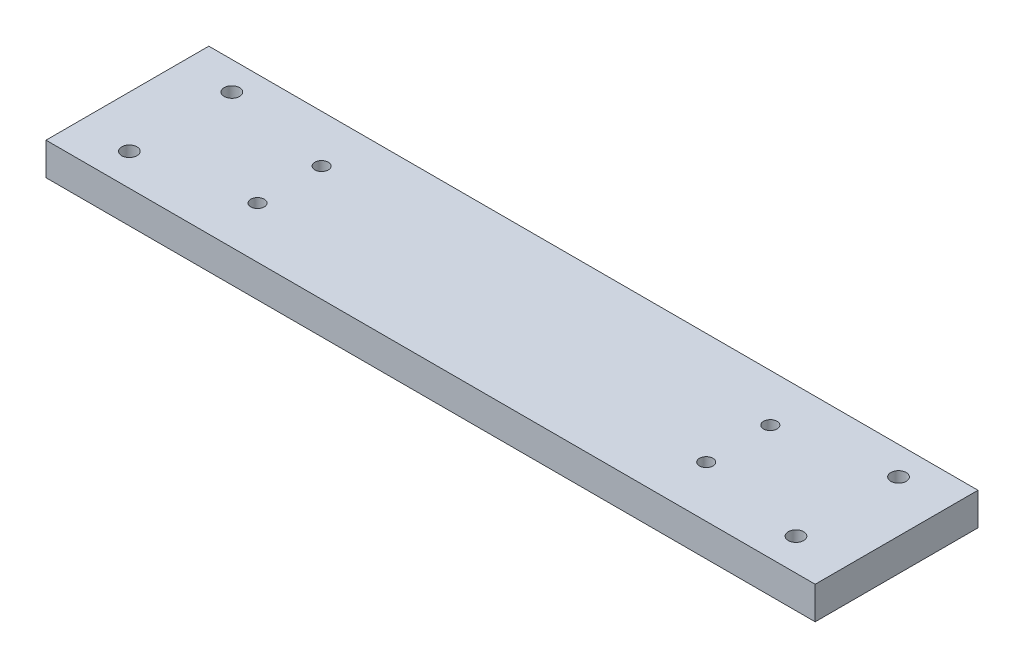
ISO-10303-21;
HEADER;
FILE_DESCRIPTION(('STEP AP214'),'2;1');
FILE_NAME('part.step','',(''),(''),'','','');
FILE_SCHEMA(('AUTOMOTIVE_DESIGN { 1 0 10303 214 1 1 1 1 }'));
ENDSEC;
DATA;
#1=APPLICATION_CONTEXT('core data for automotive mechanical design processes');
#2=APPLICATION_PROTOCOL_DEFINITION('international standard','automotive_design',2000,#1);
#3=PRODUCT_CONTEXT('',#1,'mechanical');
#4=PRODUCT('Part','Part','',(#3));
#5=PRODUCT_RELATED_PRODUCT_CATEGORY('part','',(#4));
#6=PRODUCT_DEFINITION_FORMATION('','',#4);
#7=PRODUCT_DEFINITION_CONTEXT('part definition',#1,'design');
#8=PRODUCT_DEFINITION('design','',#6,#7);
#9=PRODUCT_DEFINITION_SHAPE('','',#8);
#10=(LENGTH_UNIT() NAMED_UNIT(*) SI_UNIT(.MILLI.,.METRE.));
#11=(NAMED_UNIT(*) PLANE_ANGLE_UNIT() SI_UNIT($,.RADIAN.));
#12=(NAMED_UNIT(*) SI_UNIT($,.STERADIAN.) SOLID_ANGLE_UNIT());
#13=UNCERTAINTY_MEASURE_WITH_UNIT(LENGTH_MEASURE(1.E-05),#10,'distance_accuracy_value','');
#14=(GEOMETRIC_REPRESENTATION_CONTEXT(3) GLOBAL_UNCERTAINTY_ASSIGNED_CONTEXT((#13)) GLOBAL_UNIT_ASSIGNED_CONTEXT((#10,
#11,#12)) REPRESENTATION_CONTEXT('',''));
#15=CARTESIAN_POINT('',(0.,0.,0.));
#16=DIRECTION('',(0.,0.,1.));
#17=DIRECTION('',(1.,0.,0.));
#18=AXIS2_PLACEMENT_3D('',#15,#16,#17);
#19=CARTESIAN_POINT('',(0.,25.4,0.));
#20=DIRECTION('',(1.,0.,0.));
#21=DIRECTION('',(0.,0.,-1.));
#22=AXIS2_PLACEMENT_3D('',#19,#20,#21);
#23=PLANE('',#22);
#24=DIRECTION('',(0.,0.,1.));
#25=VECTOR('',#24,1.);
#26=CARTESIAN_POINT('',(0.,0.,0.));
#27=LINE('',#26,#25);
#28=CARTESIAN_POINT('',(0.,0.,-127.));
#29=VERTEX_POINT('',#28);
#30=CARTESIAN_POINT('',(0.,0.,0.));
#31=VERTEX_POINT('',#30);
#32=EDGE_CURVE('E96',#29,#31,#27,.T.);
#33=ORIENTED_EDGE('',*,*,#32,.T.);
#34=DIRECTION('',(0.,-1.,0.));
#35=VECTOR('',#34,1.);
#36=CARTESIAN_POINT('',(0.,25.4,0.));
#37=LINE('',#36,#35);
#38=CARTESIAN_POINT('',(0.,25.4,0.));
#39=VERTEX_POINT('',#38);
#40=EDGE_CURVE('E11',#39,#31,#37,.T.);
#41=ORIENTED_EDGE('',*,*,#40,.F.);
#42=DIRECTION('',(0.,0.,1.));
#43=VECTOR('',#42,1.);
#44=CARTESIAN_POINT('',(0.,25.4,0.));
#45=LINE('',#44,#43);
#46=CARTESIAN_POINT('',(0.,25.4,-127.));
#47=VERTEX_POINT('',#46);
#48=EDGE_CURVE('E84',#47,#39,#45,.T.);
#49=ORIENTED_EDGE('',*,*,#48,.F.);
#50=DIRECTION('',(0.,-1.,0.));
#51=VECTOR('',#50,1.);
#52=CARTESIAN_POINT('',(0.,25.4,-127.));
#53=LINE('',#52,#51);
#54=EDGE_CURVE('E92',#47,#29,#53,.T.);
#55=ORIENTED_EDGE('',*,*,#54,.T.);
#56=EDGE_LOOP('',(#33,#41,#49,#55));
#57=FACE_BOUND('',#56,.T.);
#58=ADVANCED_FACE('F33',(#57),#23,.F.);
#59=CARTESIAN_POINT('',(0.,25.4,0.));
#60=DIRECTION('',(0.,0.,-1.));
#61=DIRECTION('',(-1.,0.,0.));
#62=AXIS2_PLACEMENT_3D('',#59,#60,#61);
#63=PLANE('',#62);
#64=DIRECTION('',(1.,0.,0.));
#65=VECTOR('',#64,1.);
#66=CARTESIAN_POINT('',(0.,0.,0.));
#67=LINE('',#66,#65);
#68=CARTESIAN_POINT('',(600.,0.,0.));
#69=VERTEX_POINT('',#68);
#70=EDGE_CURVE('E88',#31,#69,#67,.T.);
#71=ORIENTED_EDGE('',*,*,#70,.T.);
#72=DIRECTION('',(0.,-1.,0.));
#73=VECTOR('',#72,1.);
#74=CARTESIAN_POINT('',(600.,25.4,0.));
#75=LINE('',#74,#73);
#76=CARTESIAN_POINT('',(600.,25.4,0.));
#77=VERTEX_POINT('',#76);
#78=EDGE_CURVE('E41',#77,#69,#75,.T.);
#79=ORIENTED_EDGE('',*,*,#78,.F.);
#80=DIRECTION('',(1.,0.,0.));
#81=VECTOR('',#80,1.);
#82=CARTESIAN_POINT('',(0.,25.4,0.));
#83=LINE('',#82,#81);
#84=EDGE_CURVE('E79',#39,#77,#83,.T.);
#85=ORIENTED_EDGE('',*,*,#84,.F.);
#86=ORIENTED_EDGE('',*,*,#40,.T.);
#87=EDGE_LOOP('',(#71,#79,#85,#86));
#88=FACE_BOUND('',#87,.T.);
#89=ADVANCED_FACE('F87',(#88),#63,.F.);
#90=CARTESIAN_POINT('',(600.,25.4,0.));
#91=DIRECTION('',(-1.,0.,0.));
#92=DIRECTION('',(0.,0.,1.));
#93=AXIS2_PLACEMENT_3D('',#90,#91,#92);
#94=PLANE('',#93);
#95=DIRECTION('',(0.,0.,-1.));
#96=VECTOR('',#95,1.);
#97=CARTESIAN_POINT('',(600.,0.,0.));
#98=LINE('',#97,#96);
#99=CARTESIAN_POINT('',(600.,0.,-127.));
#100=VERTEX_POINT('',#99);
#101=EDGE_CURVE('E66',#69,#100,#98,.T.);
#102=ORIENTED_EDGE('',*,*,#101,.T.);
#103=DIRECTION('',(0.,-1.,0.));
#104=VECTOR('',#103,1.);
#105=CARTESIAN_POINT('',(600.,25.4,-127.));
#106=LINE('',#105,#104);
#107=CARTESIAN_POINT('',(600.,25.4,-127.));
#108=VERTEX_POINT('',#107);
#109=EDGE_CURVE('E89',#108,#100,#106,.T.);
#110=ORIENTED_EDGE('',*,*,#109,.F.);
#111=DIRECTION('',(0.,0.,-1.));
#112=VECTOR('',#111,1.);
#113=CARTESIAN_POINT('',(600.,25.4,0.));
#114=LINE('',#113,#112);
#115=EDGE_CURVE('E82',#77,#108,#114,.T.);
#116=ORIENTED_EDGE('',*,*,#115,.F.);
#117=ORIENTED_EDGE('',*,*,#78,.T.);
#118=EDGE_LOOP('',(#102,#110,#116,#117));
#119=FACE_BOUND('',#118,.T.);
#120=ADVANCED_FACE('F90',(#119),#94,.F.);
#121=CARTESIAN_POINT('',(0.,25.4,-127.));
#122=DIRECTION('',(0.,0.,1.));
#123=DIRECTION('',(1.,0.,0.));
#124=AXIS2_PLACEMENT_3D('',#121,#122,#123);
#125=PLANE('',#124);
#126=DIRECTION('',(-1.,0.,0.));
#127=VECTOR('',#126,1.);
#128=CARTESIAN_POINT('',(0.,0.,-127.));
#129=LINE('',#128,#127);
#130=EDGE_CURVE('E72',#100,#29,#129,.T.);
#131=ORIENTED_EDGE('',*,*,#130,.T.);
#132=ORIENTED_EDGE('',*,*,#54,.F.);
#133=DIRECTION('',(-1.,0.,0.));
#134=VECTOR('',#133,1.);
#135=CARTESIAN_POINT('',(0.,25.4,-127.));
#136=LINE('',#135,#134);
#137=EDGE_CURVE('E49',#108,#47,#136,.T.);
#138=ORIENTED_EDGE('',*,*,#137,.F.);
#139=ORIENTED_EDGE('',*,*,#109,.T.);
#140=EDGE_LOOP('',(#131,#132,#138,#139));
#141=FACE_BOUND('',#140,.T.);
#142=ADVANCED_FACE('F104',(#141),#125,.F.);
#143=CARTESIAN_POINT('',(0.,25.4,-127.));
#144=DIRECTION('',(0.,-1.,0.));
#145=DIRECTION('',(0.,0.,-1.));
#146=AXIS2_PLACEMENT_3D('',#143,#144,#145);
#147=PLANE('',#146);
#148=CARTESIAN_POINT('',(475.,25.4,-90.));
#149=DIRECTION('',(0.,1.,0.));
#150=DIRECTION('',(0.,0.,1.));
#151=AXIS2_PLACEMENT_3D('',#148,#149,#150);
#152=CIRCLE('',#151,5.25);
#153=CARTESIAN_POINT('',(475.,25.4,-84.75));
#154=VERTEX_POINT('',#153);
#155=EDGE_CURVE('E149',#154,#154,#152,.T.);
#156=ORIENTED_EDGE('',*,*,#155,.F.);
#157=EDGE_LOOP('',(#156));
#158=FACE_BOUND('',#157,.T.);
#159=CARTESIAN_POINT('',(475.,25.4,-40.));
#160=DIRECTION('',(0.,1.,0.));
#161=DIRECTION('',(0.,0.,1.));
#162=AXIS2_PLACEMENT_3D('',#159,#160,#161);
#163=CIRCLE('',#162,5.25000000000006);
#164=CARTESIAN_POINT('',(475.,25.4,-34.75));
#165=VERTEX_POINT('',#164);
#166=EDGE_CURVE('E143',#165,#165,#163,.T.);
#167=ORIENTED_EDGE('',*,*,#166,.F.);
#168=EDGE_LOOP('',(#167));
#169=FACE_BOUND('',#168,.T.);
#170=CARTESIAN_POINT('',(125.,25.4,-40.));
#171=DIRECTION('',(0.,1.,0.));
#172=DIRECTION('',(0.,0.,1.));
#173=AXIS2_PLACEMENT_3D('',#170,#171,#172);
#174=CIRCLE('',#173,5.25);
#175=CARTESIAN_POINT('',(125.,25.4,-34.75));
#176=VERTEX_POINT('',#175);
#177=EDGE_CURVE('E137',#176,#176,#174,.T.);
#178=ORIENTED_EDGE('',*,*,#177,.F.);
#179=EDGE_LOOP('',(#178));
#180=FACE_BOUND('',#179,.T.);
#181=CARTESIAN_POINT('',(125.,25.4,-90.));
#182=DIRECTION('',(0.,1.,0.));
#183=DIRECTION('',(0.,0.,1.));
#184=AXIS2_PLACEMENT_3D('',#181,#182,#183);
#185=CIRCLE('',#184,5.25000000000003);
#186=CARTESIAN_POINT('',(125.,25.4,-84.75));
#187=VERTEX_POINT('',#186);
#188=EDGE_CURVE('E134',#187,#187,#185,.T.);
#189=ORIENTED_EDGE('',*,*,#188,.F.);
#190=EDGE_LOOP('',(#189));
#191=FACE_BOUND('',#190,.T.);
#192=CARTESIAN_POINT('',(40.0000000000001,25.4,-105.));
#193=DIRECTION('',(0.,1.,0.));
#194=DIRECTION('',(0.,0.,1.));
#195=AXIS2_PLACEMENT_3D('',#192,#193,#194);
#196=CIRCLE('',#195,6.00000000000002);
#197=CARTESIAN_POINT('',(40.0000000000001,25.4,-99.));
#198=VERTEX_POINT('',#197);
#199=EDGE_CURVE('E125',#198,#198,#196,.T.);
#200=ORIENTED_EDGE('',*,*,#199,.F.);
#201=EDGE_LOOP('',(#200));
#202=FACE_BOUND('',#201,.T.);
#203=CARTESIAN_POINT('',(40.0000000000001,25.4,-25.));
#204=DIRECTION('',(0.,1.,0.));
#205=DIRECTION('',(0.,0.,1.));
#206=AXIS2_PLACEMENT_3D('',#203,#204,#205);
#207=CIRCLE('',#206,6.00000000000001);
#208=CARTESIAN_POINT('',(40.0000000000001,25.4,-19.));
#209=VERTEX_POINT('',#208);
#210=EDGE_CURVE('E119',#209,#209,#207,.T.);
#211=ORIENTED_EDGE('',*,*,#210,.F.);
#212=EDGE_LOOP('',(#211));
#213=FACE_BOUND('',#212,.T.);
#214=CARTESIAN_POINT('',(560.,25.4,-105.));
#215=DIRECTION('',(0.,1.,0.));
#216=DIRECTION('',(0.,0.,1.));
#217=AXIS2_PLACEMENT_3D('',#214,#215,#216);
#218=CIRCLE('',#217,5.99999999999999);
#219=CARTESIAN_POINT('',(560.,25.4,-99.));
#220=VERTEX_POINT('',#219);
#221=EDGE_CURVE('E113',#220,#220,#218,.T.);
#222=ORIENTED_EDGE('',*,*,#221,.F.);
#223=EDGE_LOOP('',(#222));
#224=FACE_BOUND('',#223,.T.);
#225=CARTESIAN_POINT('',(560.,25.4,-25.));
#226=DIRECTION('',(0.,1.,0.));
#227=DIRECTION('',(0.,0.,1.));
#228=AXIS2_PLACEMENT_3D('',#225,#226,#227);
#229=CIRCLE('',#228,5.99999999999999);
#230=CARTESIAN_POINT('',(560.,25.4,-19.));
#231=VERTEX_POINT('',#230);
#232=EDGE_CURVE('E110',#231,#231,#229,.T.);
#233=ORIENTED_EDGE('',*,*,#232,.F.);
#234=EDGE_LOOP('',(#233));
#235=FACE_BOUND('',#234,.T.);
#236=ORIENTED_EDGE('',*,*,#48,.T.);
#237=ORIENTED_EDGE('',*,*,#84,.T.);
#238=ORIENTED_EDGE('',*,*,#115,.T.);
#239=ORIENTED_EDGE('',*,*,#137,.T.);
#240=EDGE_LOOP('',(#236,#237,#238,#239));
#241=FACE_BOUND('',#240,.T.);
#242=ADVANCED_FACE('F80',(#158,#169,#180,#191,#202,#213,#224,#235,#241),#147,.F.);
#243=CARTESIAN_POINT('',(0.,0.,-127.));
#244=DIRECTION('',(0.,-1.,0.));
#245=DIRECTION('',(0.,0.,-1.));
#246=AXIS2_PLACEMENT_3D('',#243,#244,#245);
#247=PLANE('',#246);
#248=CARTESIAN_POINT('',(475.,0.,-90.));
#249=DIRECTION('',(0.,1.,0.));
#250=DIRECTION('',(0.,0.,1.));
#251=AXIS2_PLACEMENT_3D('',#248,#249,#250);
#252=CIRCLE('',#251,5.25);
#253=CARTESIAN_POINT('',(475.,0.,-84.75));
#254=VERTEX_POINT('',#253);
#255=EDGE_CURVE('E152',#254,#254,#252,.T.);
#256=ORIENTED_EDGE('',*,*,#255,.T.);
#257=EDGE_LOOP('',(#256));
#258=FACE_BOUND('',#257,.T.);
#259=CARTESIAN_POINT('',(475.,0.,-40.));
#260=DIRECTION('',(0.,1.,0.));
#261=DIRECTION('',(0.,0.,1.));
#262=AXIS2_PLACEMENT_3D('',#259,#260,#261);
#263=CIRCLE('',#262,5.25000000000006);
#264=CARTESIAN_POINT('',(475.,0.,-34.75));
#265=VERTEX_POINT('',#264);
#266=EDGE_CURVE('E146',#265,#265,#263,.T.);
#267=ORIENTED_EDGE('',*,*,#266,.T.);
#268=EDGE_LOOP('',(#267));
#269=FACE_BOUND('',#268,.T.);
#270=CARTESIAN_POINT('',(125.,0.,-40.));
#271=DIRECTION('',(0.,1.,0.));
#272=DIRECTION('',(0.,0.,1.));
#273=AXIS2_PLACEMENT_3D('',#270,#271,#272);
#274=CIRCLE('',#273,5.25);
#275=CARTESIAN_POINT('',(125.,0.,-34.75));
#276=VERTEX_POINT('',#275);
#277=EDGE_CURVE('E140',#276,#276,#274,.T.);
#278=ORIENTED_EDGE('',*,*,#277,.T.);
#279=EDGE_LOOP('',(#278));
#280=FACE_BOUND('',#279,.T.);
#281=CARTESIAN_POINT('',(125.,0.,-90.));
#282=DIRECTION('',(0.,1.,0.));
#283=DIRECTION('',(0.,0.,1.));
#284=AXIS2_PLACEMENT_3D('',#281,#282,#283);
#285=CIRCLE('',#284,5.25000000000003);
#286=CARTESIAN_POINT('',(125.,0.,-84.75));
#287=VERTEX_POINT('',#286);
#288=EDGE_CURVE('E131',#287,#287,#285,.T.);
#289=ORIENTED_EDGE('',*,*,#288,.T.);
#290=EDGE_LOOP('',(#289));
#291=FACE_BOUND('',#290,.T.);
#292=CARTESIAN_POINT('',(40.0000000000001,0.,-105.));
#293=DIRECTION('',(0.,1.,0.));
#294=DIRECTION('',(0.,0.,1.));
#295=AXIS2_PLACEMENT_3D('',#292,#293,#294);
#296=CIRCLE('',#295,6.00000000000002);
#297=CARTESIAN_POINT('',(40.0000000000001,0.,-99.));
#298=VERTEX_POINT('',#297);
#299=EDGE_CURVE('E128',#298,#298,#296,.T.);
#300=ORIENTED_EDGE('',*,*,#299,.T.);
#301=EDGE_LOOP('',(#300));
#302=FACE_BOUND('',#301,.T.);
#303=CARTESIAN_POINT('',(40.0000000000001,0.,-25.));
#304=DIRECTION('',(0.,1.,0.));
#305=DIRECTION('',(0.,0.,1.));
#306=AXIS2_PLACEMENT_3D('',#303,#304,#305);
#307=CIRCLE('',#306,6.00000000000001);
#308=CARTESIAN_POINT('',(40.0000000000001,0.,-19.));
#309=VERTEX_POINT('',#308);
#310=EDGE_CURVE('E122',#309,#309,#307,.T.);
#311=ORIENTED_EDGE('',*,*,#310,.T.);
#312=EDGE_LOOP('',(#311));
#313=FACE_BOUND('',#312,.T.);
#314=CARTESIAN_POINT('',(560.,0.,-105.));
#315=DIRECTION('',(0.,1.,0.));
#316=DIRECTION('',(0.,0.,1.));
#317=AXIS2_PLACEMENT_3D('',#314,#315,#316);
#318=CIRCLE('',#317,5.99999999999999);
#319=CARTESIAN_POINT('',(560.,0.,-99.));
#320=VERTEX_POINT('',#319);
#321=EDGE_CURVE('E116',#320,#320,#318,.T.);
#322=ORIENTED_EDGE('',*,*,#321,.T.);
#323=EDGE_LOOP('',(#322));
#324=FACE_BOUND('',#323,.T.);
#325=CARTESIAN_POINT('',(560.,0.,-25.));
#326=DIRECTION('',(0.,1.,0.));
#327=DIRECTION('',(0.,0.,1.));
#328=AXIS2_PLACEMENT_3D('',#325,#326,#327);
#329=CIRCLE('',#328,5.99999999999999);
#330=CARTESIAN_POINT('',(560.,0.,-19.));
#331=VERTEX_POINT('',#330);
#332=EDGE_CURVE('E99',#331,#331,#329,.T.);
#333=ORIENTED_EDGE('',*,*,#332,.T.);
#334=EDGE_LOOP('',(#333));
#335=FACE_BOUND('',#334,.T.);
#336=ORIENTED_EDGE('',*,*,#32,.F.);
#337=ORIENTED_EDGE('',*,*,#130,.F.);
#338=ORIENTED_EDGE('',*,*,#101,.F.);
#339=ORIENTED_EDGE('',*,*,#70,.F.);
#340=EDGE_LOOP('',(#336,#337,#338,#339));
#341=FACE_BOUND('',#340,.T.);
#342=ADVANCED_FACE('F107',(#258,#269,#280,#291,#302,#313,#324,#335,#341),#247,.T.);
#343=CARTESIAN_POINT('',(560.,0.,-25.));
#344=DIRECTION('',(0.,1.,0.));
#345=DIRECTION('',(0.,0.,1.));
#346=AXIS2_PLACEMENT_3D('',#343,#344,#345);
#347=CYLINDRICAL_SURFACE('',#346,5.99999999999999);
#348=ORIENTED_EDGE('',*,*,#332,.F.);
#349=EDGE_LOOP('',(#348));
#350=FACE_BOUND('',#349,.T.);
#351=ORIENTED_EDGE('',*,*,#232,.T.);
#352=EDGE_LOOP('',(#351));
#353=FACE_BOUND('',#352,.T.);
#354=ADVANCED_FACE('F177',(#350,#353),#347,.F.);
#355=CARTESIAN_POINT('',(560.,0.,-105.));
#356=DIRECTION('',(0.,1.,0.));
#357=DIRECTION('',(0.,0.,1.));
#358=AXIS2_PLACEMENT_3D('',#355,#356,#357);
#359=CYLINDRICAL_SURFACE('',#358,5.99999999999999);
#360=ORIENTED_EDGE('',*,*,#321,.F.);
#361=EDGE_LOOP('',(#360));
#362=FACE_BOUND('',#361,.T.);
#363=ORIENTED_EDGE('',*,*,#221,.T.);
#364=EDGE_LOOP('',(#363));
#365=FACE_BOUND('',#364,.T.);
#366=ADVANCED_FACE('F179',(#362,#365),#359,.F.);
#367=CARTESIAN_POINT('',(40.0000000000001,0.,-25.));
#368=DIRECTION('',(0.,1.,0.));
#369=DIRECTION('',(0.,0.,1.));
#370=AXIS2_PLACEMENT_3D('',#367,#368,#369);
#371=CYLINDRICAL_SURFACE('',#370,6.00000000000001);
#372=ORIENTED_EDGE('',*,*,#310,.F.);
#373=EDGE_LOOP('',(#372));
#374=FACE_BOUND('',#373,.T.);
#375=ORIENTED_EDGE('',*,*,#210,.T.);
#376=EDGE_LOOP('',(#375));
#377=FACE_BOUND('',#376,.T.);
#378=ADVANCED_FACE('F186',(#374,#377),#371,.F.);
#379=CARTESIAN_POINT('',(40.0000000000001,0.,-105.));
#380=DIRECTION('',(0.,1.,0.));
#381=DIRECTION('',(0.,0.,1.));
#382=AXIS2_PLACEMENT_3D('',#379,#380,#381);
#383=CYLINDRICAL_SURFACE('',#382,6.00000000000002);
#384=ORIENTED_EDGE('',*,*,#299,.F.);
#385=EDGE_LOOP('',(#384));
#386=FACE_BOUND('',#385,.T.);
#387=ORIENTED_EDGE('',*,*,#199,.T.);
#388=EDGE_LOOP('',(#387));
#389=FACE_BOUND('',#388,.T.);
#390=ADVANCED_FACE('F227',(#386,#389),#383,.F.);
#391=CARTESIAN_POINT('',(125.,0.,-90.));
#392=DIRECTION('',(0.,1.,0.));
#393=DIRECTION('',(0.,0.,1.));
#394=AXIS2_PLACEMENT_3D('',#391,#392,#393);
#395=CYLINDRICAL_SURFACE('',#394,5.25000000000003);
#396=ORIENTED_EDGE('',*,*,#288,.F.);
#397=EDGE_LOOP('',(#396));
#398=FACE_BOUND('',#397,.T.);
#399=ORIENTED_EDGE('',*,*,#188,.T.);
#400=EDGE_LOOP('',(#399));
#401=FACE_BOUND('',#400,.T.);
#402=ADVANCED_FACE('F221',(#398,#401),#395,.F.);
#403=CARTESIAN_POINT('',(125.,0.,-40.));
#404=DIRECTION('',(0.,1.,0.));
#405=DIRECTION('',(0.,0.,1.));
#406=AXIS2_PLACEMENT_3D('',#403,#404,#405);
#407=CYLINDRICAL_SURFACE('',#406,5.25);
#408=ORIENTED_EDGE('',*,*,#277,.F.);
#409=EDGE_LOOP('',(#408));
#410=FACE_BOUND('',#409,.T.);
#411=ORIENTED_EDGE('',*,*,#177,.T.);
#412=EDGE_LOOP('',(#411));
#413=FACE_BOUND('',#412,.T.);
#414=ADVANCED_FACE('F226',(#410,#413),#407,.F.);
#415=CARTESIAN_POINT('',(475.,0.,-40.));
#416=DIRECTION('',(0.,1.,0.));
#417=DIRECTION('',(0.,0.,1.));
#418=AXIS2_PLACEMENT_3D('',#415,#416,#417);
#419=CYLINDRICAL_SURFACE('',#418,5.25000000000006);
#420=ORIENTED_EDGE('',*,*,#266,.F.);
#421=EDGE_LOOP('',(#420));
#422=FACE_BOUND('',#421,.T.);
#423=ORIENTED_EDGE('',*,*,#166,.T.);
#424=EDGE_LOOP('',(#423));
#425=FACE_BOUND('',#424,.T.);
#426=ADVANCED_FACE('F239',(#422,#425),#419,.F.);
#427=CARTESIAN_POINT('',(475.,0.,-90.));
#428=DIRECTION('',(0.,1.,0.));
#429=DIRECTION('',(0.,0.,1.));
#430=AXIS2_PLACEMENT_3D('',#427,#428,#429);
#431=CYLINDRICAL_SURFACE('',#430,5.25);
#432=ORIENTED_EDGE('',*,*,#255,.F.);
#433=EDGE_LOOP('',(#432));
#434=FACE_BOUND('',#433,.T.);
#435=ORIENTED_EDGE('',*,*,#155,.T.);
#436=EDGE_LOOP('',(#435));
#437=FACE_BOUND('',#436,.T.);
#438=ADVANCED_FACE('F158',(#434,#437),#431,.F.);
#439=CLOSED_SHELL('',(#58,#89,#120,#142,#242,#342,#354,#366,#378,#390,#402,#414,#426,#438));
#440=MANIFOLD_SOLID_BREP('B2',#439);
#441=ADVANCED_BREP_SHAPE_REPRESENTATION('',(#18,#440),#14);
#442=SHAPE_DEFINITION_REPRESENTATION(#9,#441);
ENDSEC;
END-ISO-10303-21;
